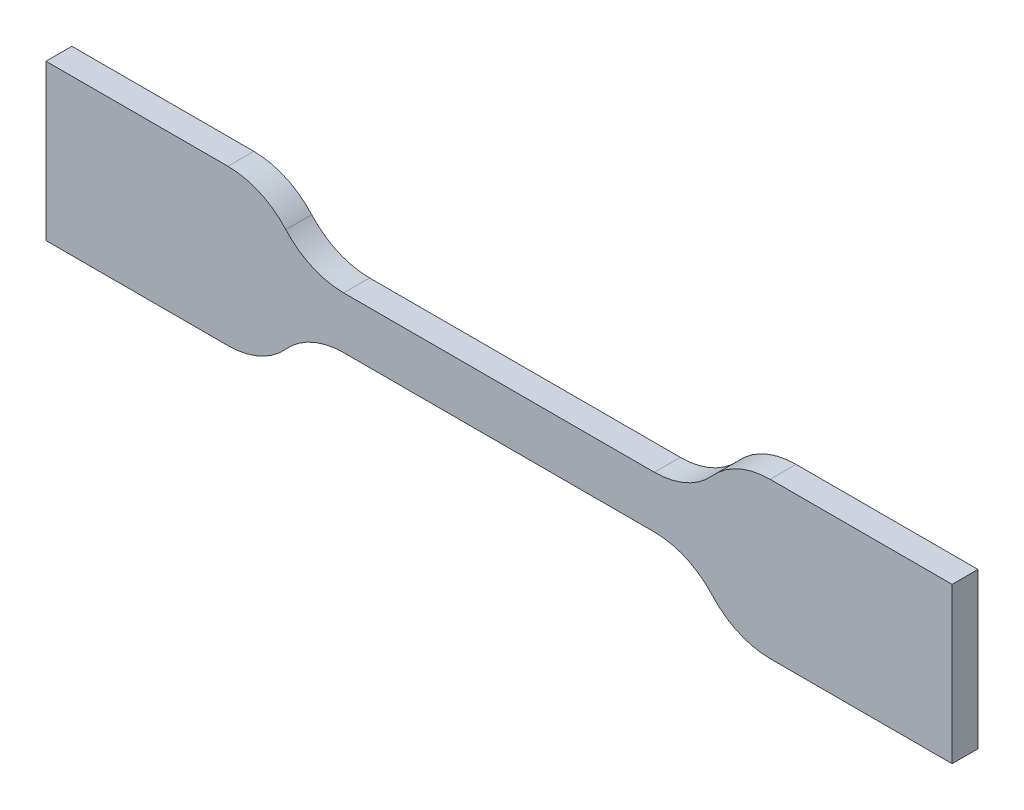
ISO-10303-21;
HEADER;
FILE_DESCRIPTION(('STEP AP214'),'2;1');
FILE_NAME('part.step','',(''),(''),'','','');
FILE_SCHEMA(('AUTOMOTIVE_DESIGN { 1 0 10303 214 1 1 1 1 }'));
ENDSEC;
DATA;
#1=APPLICATION_CONTEXT('core data for automotive mechanical design processes');
#2=APPLICATION_PROTOCOL_DEFINITION('international standard','automotive_design',2000,#1);
#3=PRODUCT_CONTEXT('',#1,'mechanical');
#4=PRODUCT('Part','Part','',(#3));
#5=PRODUCT_RELATED_PRODUCT_CATEGORY('part','',(#4));
#6=PRODUCT_DEFINITION_FORMATION('','',#4);
#7=PRODUCT_DEFINITION_CONTEXT('part definition',#1,'design');
#8=PRODUCT_DEFINITION('design','',#6,#7);
#9=PRODUCT_DEFINITION_SHAPE('','',#8);
#10=(LENGTH_UNIT() NAMED_UNIT(*) SI_UNIT(.MILLI.,.METRE.));
#11=(NAMED_UNIT(*) PLANE_ANGLE_UNIT() SI_UNIT($,.RADIAN.));
#12=(NAMED_UNIT(*) SI_UNIT($,.STERADIAN.) SOLID_ANGLE_UNIT());
#13=UNCERTAINTY_MEASURE_WITH_UNIT(LENGTH_MEASURE(1.E-05),#10,'distance_accuracy_value','');
#14=(GEOMETRIC_REPRESENTATION_CONTEXT(3) GLOBAL_UNCERTAINTY_ASSIGNED_CONTEXT((#13)) GLOBAL_UNIT_ASSIGNED_CONTEXT((#10,
#11,#12)) REPRESENTATION_CONTEXT('',''));
#15=CARTESIAN_POINT('',(0.,0.,0.));
#16=DIRECTION('',(0.,0.,1.));
#17=DIRECTION('',(1.,0.,0.));
#18=AXIS2_PLACEMENT_3D('',#15,#16,#17);
#19=CARTESIAN_POINT('',(-17.5,3.,0.5));
#20=DIRECTION('',(0.,-1.,0.));
#21=DIRECTION('',(0.,0.,-1.));
#22=AXIS2_PLACEMENT_3D('',#19,#20,#21);
#23=PLANE('',#22);
#24=DIRECTION('',(-1.,0.,0.));
#25=VECTOR('',#24,1.);
#26=CARTESIAN_POINT('',(-17.5,3.,-0.5));
#27=LINE('',#26,#25);
#28=CARTESIAN_POINT('',(-10.4721359549996,3.,-0.5));
#29=VERTEX_POINT('',#28);
#30=CARTESIAN_POINT('',(-17.5,3.,-0.5));
#31=VERTEX_POINT('',#30);
#32=EDGE_CURVE('E194',#29,#31,#27,.T.);
#33=ORIENTED_EDGE('',*,*,#32,.T.);
#34=DIRECTION('',(0.,0.,-1.));
#35=VECTOR('',#34,1.);
#36=CARTESIAN_POINT('',(-17.5,3.,0.5));
#37=LINE('',#36,#35);
#38=CARTESIAN_POINT('',(-17.5,3.,0.5));
#39=VERTEX_POINT('',#38);
#40=EDGE_CURVE('E11',#39,#31,#37,.T.);
#41=ORIENTED_EDGE('',*,*,#40,.F.);
#42=DIRECTION('',(-1.,0.,0.));
#43=VECTOR('',#42,1.);
#44=CARTESIAN_POINT('',(-17.5,3.,0.5));
#45=LINE('',#44,#43);
#46=CARTESIAN_POINT('',(-10.4721359549996,3.,0.5));
#47=VERTEX_POINT('',#46);
#48=EDGE_CURVE('E240',#47,#39,#45,.T.);
#49=ORIENTED_EDGE('',*,*,#48,.F.);
#50=DIRECTION('',(0.,0.,-1.));
#51=VECTOR('',#50,1.);
#52=CARTESIAN_POINT('',(-10.4721359549996,3.,0.5));
#53=LINE('',#52,#51);
#54=EDGE_CURVE('E190',#47,#29,#53,.T.);
#55=ORIENTED_EDGE('',*,*,#54,.T.);
#56=EDGE_LOOP('',(#33,#41,#49,#55));
#57=FACE_BOUND('',#56,.T.);
#58=ADVANCED_FACE('F45',(#57),#23,.F.);
#59=CARTESIAN_POINT('',(-17.5,3.,0.5));
#60=DIRECTION('',(1.,0.,0.));
#61=DIRECTION('',(0.,0.,-1.));
#62=AXIS2_PLACEMENT_3D('',#59,#60,#61);
#63=PLANE('',#62);
#64=DIRECTION('',(0.,-1.,0.));
#65=VECTOR('',#64,1.);
#66=CARTESIAN_POINT('',(-17.5,3.,-0.5));
#67=LINE('',#66,#65);
#68=CARTESIAN_POINT('',(-17.5,-3.,-0.5));
#69=VERTEX_POINT('',#68);
#70=EDGE_CURVE('E198',#31,#69,#67,.T.);
#71=ORIENTED_EDGE('',*,*,#70,.T.);
#72=DIRECTION('',(0.,0.,-1.));
#73=VECTOR('',#72,1.);
#74=CARTESIAN_POINT('',(-17.5,-3.,0.5));
#75=LINE('',#74,#73);
#76=CARTESIAN_POINT('',(-17.5,-3.,0.5));
#77=VERTEX_POINT('',#76);
#78=EDGE_CURVE('E54',#77,#69,#75,.T.);
#79=ORIENTED_EDGE('',*,*,#78,.F.);
#80=DIRECTION('',(0.,-1.,0.));
#81=VECTOR('',#80,1.);
#82=CARTESIAN_POINT('',(-17.5,3.,0.5));
#83=LINE('',#82,#81);
#84=EDGE_CURVE('E129',#39,#77,#83,.T.);
#85=ORIENTED_EDGE('',*,*,#84,.F.);
#86=ORIENTED_EDGE('',*,*,#40,.T.);
#87=EDGE_LOOP('',(#71,#79,#85,#86));
#88=FACE_BOUND('',#87,.T.);
#89=ADVANCED_FACE('F362',(#88),#63,.F.);
#90=CARTESIAN_POINT('',(-17.5,-3.,0.5));
#91=DIRECTION('',(0.,1.,0.));
#92=DIRECTION('',(0.,0.,1.));
#93=AXIS2_PLACEMENT_3D('',#90,#91,#92);
#94=PLANE('',#93);
#95=DIRECTION('',(1.,0.,0.));
#96=VECTOR('',#95,1.);
#97=CARTESIAN_POINT('',(-17.5,-3.,-0.5));
#98=LINE('',#97,#96);
#99=CARTESIAN_POINT('',(-10.4721359549996,-3.,-0.5));
#100=VERTEX_POINT('',#99);
#101=EDGE_CURVE('E201',#69,#100,#98,.T.);
#102=ORIENTED_EDGE('',*,*,#101,.T.);
#103=DIRECTION('',(0.,0.,-1.));
#104=VECTOR('',#103,1.);
#105=CARTESIAN_POINT('',(-10.4721359549996,-3.,0.5));
#106=LINE('',#105,#104);
#107=CARTESIAN_POINT('',(-10.4721359549996,-3.,0.5));
#108=VERTEX_POINT('',#107);
#109=EDGE_CURVE('E283',#108,#100,#106,.T.);
#110=ORIENTED_EDGE('',*,*,#109,.F.);
#111=DIRECTION('',(1.,0.,0.));
#112=VECTOR('',#111,1.);
#113=CARTESIAN_POINT('',(-17.5,-3.,0.5));
#114=LINE('',#113,#112);
#115=EDGE_CURVE('E293',#77,#108,#114,.T.);
#116=ORIENTED_EDGE('',*,*,#115,.F.);
#117=ORIENTED_EDGE('',*,*,#78,.T.);
#118=EDGE_LOOP('',(#102,#110,#116,#117));
#119=FACE_BOUND('',#118,.T.);
#120=ADVANCED_FACE('F291',(#119),#94,.F.);
#121=CARTESIAN_POINT('',(-10.4721359549996,0.,0.5));
#122=DIRECTION('',(0.,0.,-1.));
#123=DIRECTION('',(-1.,0.,0.));
#124=AXIS2_PLACEMENT_3D('',#121,#122,#123);
#125=CYLINDRICAL_SURFACE('',#124,3.);
#126=CARTESIAN_POINT('',(-10.4721359549996,0.,-0.5));
#127=DIRECTION('',(0.,0.,1.));
#128=DIRECTION('',(-1.,0.,0.));
#129=AXIS2_PLACEMENT_3D('',#126,#127,#128);
#130=CIRCLE('',#129,3.);
#131=CARTESIAN_POINT('',(-8.23606797749979,-2.,-0.5));
#132=VERTEX_POINT('',#131);
#133=EDGE_CURVE('E204',#100,#132,#130,.T.);
#134=ORIENTED_EDGE('',*,*,#133,.T.);
#135=DIRECTION('',(0.,0.,-1.));
#136=VECTOR('',#135,1.);
#137=CARTESIAN_POINT('',(-8.23606797749979,-2.,0.5));
#138=LINE('',#137,#136);
#139=CARTESIAN_POINT('',(-8.23606797749979,-2.,0.5));
#140=VERTEX_POINT('',#139);
#141=EDGE_CURVE('E279',#140,#132,#138,.T.);
#142=ORIENTED_EDGE('',*,*,#141,.F.);
#143=CARTESIAN_POINT('',(-10.4721359549996,0.,0.5));
#144=DIRECTION('',(0.,0.,1.));
#145=DIRECTION('',(-1.,0.,0.));
#146=AXIS2_PLACEMENT_3D('',#143,#144,#145);
#147=CIRCLE('',#146,3.);
#148=EDGE_CURVE('E312',#108,#140,#147,.T.);
#149=ORIENTED_EDGE('',*,*,#148,.F.);
#150=ORIENTED_EDGE('',*,*,#109,.T.);
#151=EDGE_LOOP('',(#134,#142,#149,#150));
#152=FACE_BOUND('',#151,.T.);
#153=ADVANCED_FACE('F302',(#152),#125,.T.);
#154=CARTESIAN_POINT('',(-6.,-4.00000000000001,0.5));
#155=DIRECTION('',(0.,0.,-1.));
#156=DIRECTION('',(-1.,0.,0.));
#157=AXIS2_PLACEMENT_3D('',#154,#155,#156);
#158=CYLINDRICAL_SURFACE('',#157,3.);
#159=CARTESIAN_POINT('',(-6.,-4.00000000000001,-0.5));
#160=DIRECTION('',(0.,0.,-1.));
#161=DIRECTION('',(1.,0.,0.));
#162=AXIS2_PLACEMENT_3D('',#159,#160,#161);
#163=CIRCLE('',#162,3.);
#164=CARTESIAN_POINT('',(-6.,-1.00000000000001,-0.5));
#165=VERTEX_POINT('',#164);
#166=EDGE_CURVE('E207',#132,#165,#163,.T.);
#167=ORIENTED_EDGE('',*,*,#166,.T.);
#168=DIRECTION('',(0.,0.,-1.));
#169=VECTOR('',#168,1.);
#170=CARTESIAN_POINT('',(-6.,-1.00000000000001,0.5));
#171=LINE('',#170,#169);
#172=CARTESIAN_POINT('',(-6.,-1.00000000000001,0.5));
#173=VERTEX_POINT('',#172);
#174=EDGE_CURVE('E275',#173,#165,#171,.T.);
#175=ORIENTED_EDGE('',*,*,#174,.F.);
#176=CARTESIAN_POINT('',(-6.,-4.00000000000001,0.5));
#177=DIRECTION('',(0.,0.,-1.));
#178=DIRECTION('',(1.,0.,0.));
#179=AXIS2_PLACEMENT_3D('',#176,#177,#178);
#180=CIRCLE('',#179,3.);
#181=EDGE_CURVE('E308',#140,#173,#180,.T.);
#182=ORIENTED_EDGE('',*,*,#181,.F.);
#183=ORIENTED_EDGE('',*,*,#141,.T.);
#184=EDGE_LOOP('',(#167,#175,#182,#183));
#185=FACE_BOUND('',#184,.T.);
#186=ADVANCED_FACE('F306',(#185),#158,.F.);
#187=CARTESIAN_POINT('',(-6.,-1.00000000000001,0.5));
#188=DIRECTION('',(0.,1.,0.));
#189=DIRECTION('',(0.,0.,1.));
#190=AXIS2_PLACEMENT_3D('',#187,#188,#189);
#191=PLANE('',#190);
#192=DIRECTION('',(1.,0.,0.));
#193=VECTOR('',#192,1.);
#194=CARTESIAN_POINT('',(-6.,-1.00000000000001,-0.5));
#195=LINE('',#194,#193);
#196=CARTESIAN_POINT('',(6.,-1.00000000000001,-0.5));
#197=VERTEX_POINT('',#196);
#198=EDGE_CURVE('E210',#165,#197,#195,.T.);
#199=ORIENTED_EDGE('',*,*,#198,.T.);
#200=DIRECTION('',(0.,0.,-1.));
#201=VECTOR('',#200,1.);
#202=CARTESIAN_POINT('',(6.,-1.00000000000001,0.5));
#203=LINE('',#202,#201);
#204=CARTESIAN_POINT('',(6.,-1.00000000000001,0.5));
#205=VERTEX_POINT('',#204);
#206=EDGE_CURVE('E271',#205,#197,#203,.T.);
#207=ORIENTED_EDGE('',*,*,#206,.F.);
#208=DIRECTION('',(1.,0.,0.));
#209=VECTOR('',#208,1.);
#210=CARTESIAN_POINT('',(-6.,-1.00000000000001,0.5));
#211=LINE('',#210,#209);
#212=EDGE_CURVE('E311',#173,#205,#211,.T.);
#213=ORIENTED_EDGE('',*,*,#212,.F.);
#214=ORIENTED_EDGE('',*,*,#174,.T.);
#215=EDGE_LOOP('',(#199,#207,#213,#214));
#216=FACE_BOUND('',#215,.T.);
#217=ADVANCED_FACE('F375',(#216),#191,.F.);
#218=CARTESIAN_POINT('',(6.,-4.00000000000001,0.5));
#219=DIRECTION('',(0.,0.,-1.));
#220=DIRECTION('',(-1.,0.,0.));
#221=AXIS2_PLACEMENT_3D('',#218,#219,#220);
#222=CYLINDRICAL_SURFACE('',#221,3.);
#223=CARTESIAN_POINT('',(6.,-4.00000000000001,-0.5));
#224=DIRECTION('',(0.,0.,-1.));
#225=DIRECTION('',(1.,0.,0.));
#226=AXIS2_PLACEMENT_3D('',#223,#224,#225);
#227=CIRCLE('',#226,3.);
#228=CARTESIAN_POINT('',(8.23606797749979,-2.00000000000001,-0.5));
#229=VERTEX_POINT('',#228);
#230=EDGE_CURVE('E213',#197,#229,#227,.T.);
#231=ORIENTED_EDGE('',*,*,#230,.T.);
#232=DIRECTION('',(0.,0.,-1.));
#233=VECTOR('',#232,1.);
#234=CARTESIAN_POINT('',(8.23606797749979,-2.00000000000001,0.5));
#235=LINE('',#234,#233);
#236=CARTESIAN_POINT('',(8.23606797749979,-2.00000000000001,0.5));
#237=VERTEX_POINT('',#236);
#238=EDGE_CURVE('E267',#237,#229,#235,.T.);
#239=ORIENTED_EDGE('',*,*,#238,.F.);
#240=CARTESIAN_POINT('',(6.,-4.00000000000001,0.5));
#241=DIRECTION('',(0.,0.,-1.));
#242=DIRECTION('',(1.,0.,0.));
#243=AXIS2_PLACEMENT_3D('',#240,#241,#242);
#244=CIRCLE('',#243,3.);
#245=EDGE_CURVE('E316',#205,#237,#244,.T.);
#246=ORIENTED_EDGE('',*,*,#245,.F.);
#247=ORIENTED_EDGE('',*,*,#206,.T.);
#248=EDGE_LOOP('',(#231,#239,#246,#247));
#249=FACE_BOUND('',#248,.T.);
#250=ADVANCED_FACE('F378',(#249),#222,.F.);
#251=CARTESIAN_POINT('',(10.4721359549996,0.,0.5));
#252=DIRECTION('',(0.,0.,-1.));
#253=DIRECTION('',(-1.,0.,0.));
#254=AXIS2_PLACEMENT_3D('',#251,#252,#253);
#255=CYLINDRICAL_SURFACE('',#254,3.);
#256=CARTESIAN_POINT('',(10.4721359549996,0.,-0.5));
#257=DIRECTION('',(0.,0.,1.));
#258=DIRECTION('',(-1.,0.,0.));
#259=AXIS2_PLACEMENT_3D('',#256,#257,#258);
#260=CIRCLE('',#259,3.);
#261=CARTESIAN_POINT('',(10.4721359549996,-3.,-0.5));
#262=VERTEX_POINT('',#261);
#263=EDGE_CURVE('E216',#229,#262,#260,.T.);
#264=ORIENTED_EDGE('',*,*,#263,.T.);
#265=DIRECTION('',(0.,0.,-1.));
#266=VECTOR('',#265,1.);
#267=CARTESIAN_POINT('',(10.4721359549996,-3.,0.5));
#268=LINE('',#267,#266);
#269=CARTESIAN_POINT('',(10.4721359549996,-3.,0.5));
#270=VERTEX_POINT('',#269);
#271=EDGE_CURVE('E263',#270,#262,#268,.T.);
#272=ORIENTED_EDGE('',*,*,#271,.F.);
#273=CARTESIAN_POINT('',(10.4721359549996,0.,0.5));
#274=DIRECTION('',(0.,0.,1.));
#275=DIRECTION('',(-1.,0.,0.));
#276=AXIS2_PLACEMENT_3D('',#273,#274,#275);
#277=CIRCLE('',#276,3.);
#278=EDGE_CURVE('E323',#237,#270,#277,.T.);
#279=ORIENTED_EDGE('',*,*,#278,.F.);
#280=ORIENTED_EDGE('',*,*,#238,.T.);
#281=EDGE_LOOP('',(#264,#272,#279,#280));
#282=FACE_BOUND('',#281,.T.);
#283=ADVANCED_FACE('F382',(#282),#255,.T.);
#284=CARTESIAN_POINT('',(17.5,-3.,0.5));
#285=DIRECTION('',(0.,1.,0.));
#286=DIRECTION('',(0.,0.,1.));
#287=AXIS2_PLACEMENT_3D('',#284,#285,#286);
#288=PLANE('',#287);
#289=DIRECTION('',(1.,0.,0.));
#290=VECTOR('',#289,1.);
#291=CARTESIAN_POINT('',(17.5,-3.,-0.5));
#292=LINE('',#291,#290);
#293=CARTESIAN_POINT('',(17.5,-3.,-0.5));
#294=VERTEX_POINT('',#293);
#295=EDGE_CURVE('E219',#262,#294,#292,.T.);
#296=ORIENTED_EDGE('',*,*,#295,.T.);
#297=DIRECTION('',(0.,0.,-1.));
#298=VECTOR('',#297,1.);
#299=CARTESIAN_POINT('',(17.5,-3.,0.5));
#300=LINE('',#299,#298);
#301=CARTESIAN_POINT('',(17.5,-3.,0.5));
#302=VERTEX_POINT('',#301);
#303=EDGE_CURVE('E259',#302,#294,#300,.T.);
#304=ORIENTED_EDGE('',*,*,#303,.F.);
#305=DIRECTION('',(1.,0.,0.));
#306=VECTOR('',#305,1.);
#307=CARTESIAN_POINT('',(17.5,-3.,0.5));
#308=LINE('',#307,#306);
#309=EDGE_CURVE('E326',#270,#302,#308,.T.);
#310=ORIENTED_EDGE('',*,*,#309,.F.);
#311=ORIENTED_EDGE('',*,*,#271,.T.);
#312=EDGE_LOOP('',(#296,#304,#310,#311));
#313=FACE_BOUND('',#312,.T.);
#314=ADVANCED_FACE('F386',(#313),#288,.F.);
#315=CARTESIAN_POINT('',(17.5,3.,0.5));
#316=DIRECTION('',(-1.,0.,0.));
#317=DIRECTION('',(0.,0.,1.));
#318=AXIS2_PLACEMENT_3D('',#315,#316,#317);
#319=PLANE('',#318);
#320=DIRECTION('',(0.,1.,0.));
#321=VECTOR('',#320,1.);
#322=CARTESIAN_POINT('',(17.5,3.,-0.5));
#323=LINE('',#322,#321);
#324=CARTESIAN_POINT('',(17.5,3.,-0.5));
#325=VERTEX_POINT('',#324);
#326=EDGE_CURVE('E222',#294,#325,#323,.T.);
#327=ORIENTED_EDGE('',*,*,#326,.T.);
#328=DIRECTION('',(0.,0.,-1.));
#329=VECTOR('',#328,1.);
#330=CARTESIAN_POINT('',(17.5,3.,0.5));
#331=LINE('',#330,#329);
#332=CARTESIAN_POINT('',(17.5,3.,0.5));
#333=VERTEX_POINT('',#332);
#334=EDGE_CURVE('E255',#333,#325,#331,.T.);
#335=ORIENTED_EDGE('',*,*,#334,.F.);
#336=DIRECTION('',(0.,1.,0.));
#337=VECTOR('',#336,1.);
#338=CARTESIAN_POINT('',(17.5,3.,0.5));
#339=LINE('',#338,#337);
#340=EDGE_CURVE('E329',#302,#333,#339,.T.);
#341=ORIENTED_EDGE('',*,*,#340,.F.);
#342=ORIENTED_EDGE('',*,*,#303,.T.);
#343=EDGE_LOOP('',(#327,#335,#341,#342));
#344=FACE_BOUND('',#343,.T.);
#345=ADVANCED_FACE('F390',(#344),#319,.F.);
#346=CARTESIAN_POINT('',(10.4721359549996,3.,0.5));
#347=DIRECTION('',(0.,-1.,0.));
#348=DIRECTION('',(0.,0.,-1.));
#349=AXIS2_PLACEMENT_3D('',#346,#347,#348);
#350=PLANE('',#349);
#351=DIRECTION('',(-1.,0.,0.));
#352=VECTOR('',#351,1.);
#353=CARTESIAN_POINT('',(10.4721359549996,3.,-0.5));
#354=LINE('',#353,#352);
#355=CARTESIAN_POINT('',(10.4721359549996,3.,-0.5));
#356=VERTEX_POINT('',#355);
#357=EDGE_CURVE('E225',#325,#356,#354,.T.);
#358=ORIENTED_EDGE('',*,*,#357,.T.);
#359=DIRECTION('',(0.,0.,-1.));
#360=VECTOR('',#359,1.);
#361=CARTESIAN_POINT('',(10.4721359549996,3.,0.5));
#362=LINE('',#361,#360);
#363=CARTESIAN_POINT('',(10.4721359549996,3.,0.5));
#364=VERTEX_POINT('',#363);
#365=EDGE_CURVE('E251',#364,#356,#362,.T.);
#366=ORIENTED_EDGE('',*,*,#365,.F.);
#367=DIRECTION('',(-1.,0.,0.));
#368=VECTOR('',#367,1.);
#369=CARTESIAN_POINT('',(10.4721359549996,3.,0.5));
#370=LINE('',#369,#368);
#371=EDGE_CURVE('E332',#333,#364,#370,.T.);
#372=ORIENTED_EDGE('',*,*,#371,.F.);
#373=ORIENTED_EDGE('',*,*,#334,.T.);
#374=EDGE_LOOP('',(#358,#366,#372,#373));
#375=FACE_BOUND('',#374,.T.);
#376=ADVANCED_FACE('F394',(#375),#350,.F.);
#377=CARTESIAN_POINT('',(10.4721359549996,0.,0.5));
#378=DIRECTION('',(0.,0.,-1.));
#379=DIRECTION('',(-1.,0.,0.));
#380=AXIS2_PLACEMENT_3D('',#377,#378,#379);
#381=CYLINDRICAL_SURFACE('',#380,3.);
#382=CARTESIAN_POINT('',(10.4721359549996,0.,-0.5));
#383=DIRECTION('',(0.,0.,1.));
#384=DIRECTION('',(-1.,0.,0.));
#385=AXIS2_PLACEMENT_3D('',#382,#383,#384);
#386=CIRCLE('',#385,3.);
#387=CARTESIAN_POINT('',(8.23606797749979,2.,-0.5));
#388=VERTEX_POINT('',#387);
#389=EDGE_CURVE('E228',#356,#388,#386,.T.);
#390=ORIENTED_EDGE('',*,*,#389,.T.);
#391=DIRECTION('',(0.,0.,-1.));
#392=VECTOR('',#391,1.);
#393=CARTESIAN_POINT('',(8.23606797749979,2.,0.5));
#394=LINE('',#393,#392);
#395=CARTESIAN_POINT('',(8.23606797749979,2.,0.5));
#396=VERTEX_POINT('',#395);
#397=EDGE_CURVE('E247',#396,#388,#394,.T.);
#398=ORIENTED_EDGE('',*,*,#397,.F.);
#399=CARTESIAN_POINT('',(10.4721359549996,0.,0.5));
#400=DIRECTION('',(0.,0.,1.));
#401=DIRECTION('',(-1.,0.,0.));
#402=AXIS2_PLACEMENT_3D('',#399,#400,#401);
#403=CIRCLE('',#402,3.);
#404=EDGE_CURVE('E335',#364,#396,#403,.T.);
#405=ORIENTED_EDGE('',*,*,#404,.F.);
#406=ORIENTED_EDGE('',*,*,#365,.T.);
#407=EDGE_LOOP('',(#390,#398,#405,#406));
#408=FACE_BOUND('',#407,.T.);
#409=ADVANCED_FACE('F343',(#408),#381,.T.);
#410=CARTESIAN_POINT('',(6.,3.99999999999999,0.5));
#411=DIRECTION('',(0.,0.,-1.));
#412=DIRECTION('',(-1.,0.,0.));
#413=AXIS2_PLACEMENT_3D('',#410,#411,#412);
#414=CYLINDRICAL_SURFACE('',#413,3.);
#415=CARTESIAN_POINT('',(6.,3.99999999999999,-0.5));
#416=DIRECTION('',(0.,0.,-1.));
#417=DIRECTION('',(1.,0.,0.));
#418=AXIS2_PLACEMENT_3D('',#415,#416,#417);
#419=CIRCLE('',#418,3.);
#420=CARTESIAN_POINT('',(6.,0.999999999999991,-0.5));
#421=VERTEX_POINT('',#420);
#422=EDGE_CURVE('E231',#388,#421,#419,.T.);
#423=ORIENTED_EDGE('',*,*,#422,.T.);
#424=DIRECTION('',(0.,0.,-1.));
#425=VECTOR('',#424,1.);
#426=CARTESIAN_POINT('',(6.,0.999999999999991,0.5));
#427=LINE('',#426,#425);
#428=CARTESIAN_POINT('',(6.,0.999999999999991,0.5));
#429=VERTEX_POINT('',#428);
#430=EDGE_CURVE('E183',#429,#421,#427,.T.);
#431=ORIENTED_EDGE('',*,*,#430,.F.);
#432=CARTESIAN_POINT('',(6.,3.99999999999999,0.5));
#433=DIRECTION('',(0.,0.,-1.));
#434=DIRECTION('',(1.,0.,0.));
#435=AXIS2_PLACEMENT_3D('',#432,#433,#434);
#436=CIRCLE('',#435,3.);
#437=EDGE_CURVE('E172',#396,#429,#436,.T.);
#438=ORIENTED_EDGE('',*,*,#437,.F.);
#439=ORIENTED_EDGE('',*,*,#397,.T.);
#440=EDGE_LOOP('',(#423,#431,#438,#439));
#441=FACE_BOUND('',#440,.T.);
#442=ADVANCED_FACE('F347',(#441),#414,.F.);
#443=CARTESIAN_POINT('',(-6.,0.99999999999999,0.5));
#444=DIRECTION('',(0.,-1.,0.));
#445=DIRECTION('',(0.,0.,-1.));
#446=AXIS2_PLACEMENT_3D('',#443,#444,#445);
#447=PLANE('',#446);
#448=DIRECTION('',(-1.,0.,0.));
#449=VECTOR('',#448,1.);
#450=CARTESIAN_POINT('',(-6.,0.99999999999999,-0.5));
#451=LINE('',#450,#449);
#452=CARTESIAN_POINT('',(-6.,0.99999999999999,-0.5));
#453=VERTEX_POINT('',#452);
#454=EDGE_CURVE('E181',#421,#453,#451,.T.);
#455=ORIENTED_EDGE('',*,*,#454,.T.);
#456=DIRECTION('',(0.,0.,-1.));
#457=VECTOR('',#456,1.);
#458=CARTESIAN_POINT('',(-6.,0.99999999999999,0.5));
#459=LINE('',#458,#457);
#460=CARTESIAN_POINT('',(-6.,0.99999999999999,0.5));
#461=VERTEX_POINT('',#460);
#462=EDGE_CURVE('E178',#461,#453,#459,.T.);
#463=ORIENTED_EDGE('',*,*,#462,.F.);
#464=DIRECTION('',(-1.,0.,0.));
#465=VECTOR('',#464,1.);
#466=CARTESIAN_POINT('',(-6.,0.99999999999999,0.5));
#467=LINE('',#466,#465);
#468=EDGE_CURVE('E166',#429,#461,#467,.T.);
#469=ORIENTED_EDGE('',*,*,#468,.F.);
#470=ORIENTED_EDGE('',*,*,#430,.T.);
#471=EDGE_LOOP('',(#455,#463,#469,#470));
#472=FACE_BOUND('',#471,.T.);
#473=ADVANCED_FACE('F179',(#472),#447,.F.);
#474=CARTESIAN_POINT('',(-6.,3.99999999999999,0.5));
#475=DIRECTION('',(0.,0.,-1.));
#476=DIRECTION('',(-1.,0.,0.));
#477=AXIS2_PLACEMENT_3D('',#474,#475,#476);
#478=CYLINDRICAL_SURFACE('',#477,3.);
#479=CARTESIAN_POINT('',(-6.,3.99999999999999,-0.5));
#480=DIRECTION('',(0.,0.,-1.));
#481=DIRECTION('',(1.,0.,0.));
#482=AXIS2_PLACEMENT_3D('',#479,#480,#481);
#483=CIRCLE('',#482,3.);
#484=CARTESIAN_POINT('',(-8.2360679774998,2.,-0.5));
#485=VERTEX_POINT('',#484);
#486=EDGE_CURVE('E115',#453,#485,#483,.T.);
#487=ORIENTED_EDGE('',*,*,#486,.T.);
#488=DIRECTION('',(0.,0.,-1.));
#489=VECTOR('',#488,1.);
#490=CARTESIAN_POINT('',(-8.2360679774998,2.,0.5));
#491=LINE('',#490,#489);
#492=CARTESIAN_POINT('',(-8.2360679774998,2.,0.5));
#493=VERTEX_POINT('',#492);
#494=EDGE_CURVE('E184',#493,#485,#491,.T.);
#495=ORIENTED_EDGE('',*,*,#494,.F.);
#496=CARTESIAN_POINT('',(-6.,3.99999999999999,0.5));
#497=DIRECTION('',(0.,0.,-1.));
#498=DIRECTION('',(1.,0.,0.));
#499=AXIS2_PLACEMENT_3D('',#496,#497,#498);
#500=CIRCLE('',#499,3.);
#501=EDGE_CURVE('E170',#461,#493,#500,.T.);
#502=ORIENTED_EDGE('',*,*,#501,.F.);
#503=ORIENTED_EDGE('',*,*,#462,.T.);
#504=EDGE_LOOP('',(#487,#495,#502,#503));
#505=FACE_BOUND('',#504,.T.);
#506=ADVANCED_FACE('F186',(#505),#478,.F.);
#507=CARTESIAN_POINT('',(-10.4721359549996,0.,0.5));
#508=DIRECTION('',(0.,0.,-1.));
#509=DIRECTION('',(-1.,0.,0.));
#510=AXIS2_PLACEMENT_3D('',#507,#508,#509);
#511=CYLINDRICAL_SURFACE('',#510,3.);
#512=CARTESIAN_POINT('',(-10.4721359549996,0.,-0.5));
#513=DIRECTION('',(0.,0.,1.));
#514=DIRECTION('',(-1.,0.,0.));
#515=AXIS2_PLACEMENT_3D('',#512,#513,#514);
#516=CIRCLE('',#515,3.);
#517=EDGE_CURVE('E121',#485,#29,#516,.T.);
#518=ORIENTED_EDGE('',*,*,#517,.T.);
#519=ORIENTED_EDGE('',*,*,#54,.F.);
#520=CARTESIAN_POINT('',(-10.4721359549996,0.,0.5));
#521=DIRECTION('',(0.,0.,1.));
#522=DIRECTION('',(-1.,0.,0.));
#523=AXIS2_PLACEMENT_3D('',#520,#521,#522);
#524=CIRCLE('',#523,3.);
#525=EDGE_CURVE('E62',#493,#47,#524,.T.);
#526=ORIENTED_EDGE('',*,*,#525,.F.);
#527=ORIENTED_EDGE('',*,*,#494,.T.);
#528=EDGE_LOOP('',(#518,#519,#526,#527));
#529=FACE_BOUND('',#528,.T.);
#530=ADVANCED_FACE('F351',(#529),#511,.T.);
#531=CARTESIAN_POINT('',(-10.4721359549996,0.,0.5));
#532=DIRECTION('',(0.,0.,-1.));
#533=DIRECTION('',(-1.,0.,0.));
#534=AXIS2_PLACEMENT_3D('',#531,#532,#533);
#535=PLANE('',#534);
#536=ORIENTED_EDGE('',*,*,#48,.T.);
#537=ORIENTED_EDGE('',*,*,#84,.T.);
#538=ORIENTED_EDGE('',*,*,#115,.T.);
#539=ORIENTED_EDGE('',*,*,#148,.T.);
#540=ORIENTED_EDGE('',*,*,#181,.T.);
#541=ORIENTED_EDGE('',*,*,#212,.T.);
#542=ORIENTED_EDGE('',*,*,#245,.T.);
#543=ORIENTED_EDGE('',*,*,#278,.T.);
#544=ORIENTED_EDGE('',*,*,#309,.T.);
#545=ORIENTED_EDGE('',*,*,#340,.T.);
#546=ORIENTED_EDGE('',*,*,#371,.T.);
#547=ORIENTED_EDGE('',*,*,#404,.T.);
#548=ORIENTED_EDGE('',*,*,#437,.T.);
#549=ORIENTED_EDGE('',*,*,#468,.T.);
#550=ORIENTED_EDGE('',*,*,#501,.T.);
#551=ORIENTED_EDGE('',*,*,#525,.T.);
#552=EDGE_LOOP('',(#536,#537,#538,#539,#540,#541,#542,#543,#544,#545,#546,#547,#548,#549,#550,#551));
#553=FACE_BOUND('',#552,.T.);
#554=ADVANCED_FACE('F168',(#553),#535,.F.);
#555=CARTESIAN_POINT('',(-10.4721359549996,0.,-0.5));
#556=DIRECTION('',(0.,0.,-1.));
#557=DIRECTION('',(-1.,0.,0.));
#558=AXIS2_PLACEMENT_3D('',#555,#556,#557);
#559=PLANE('',#558);
#560=ORIENTED_EDGE('',*,*,#32,.F.);
#561=ORIENTED_EDGE('',*,*,#517,.F.);
#562=ORIENTED_EDGE('',*,*,#486,.F.);
#563=ORIENTED_EDGE('',*,*,#454,.F.);
#564=ORIENTED_EDGE('',*,*,#422,.F.);
#565=ORIENTED_EDGE('',*,*,#389,.F.);
#566=ORIENTED_EDGE('',*,*,#357,.F.);
#567=ORIENTED_EDGE('',*,*,#326,.F.);
#568=ORIENTED_EDGE('',*,*,#295,.F.);
#569=ORIENTED_EDGE('',*,*,#263,.F.);
#570=ORIENTED_EDGE('',*,*,#230,.F.);
#571=ORIENTED_EDGE('',*,*,#198,.F.);
#572=ORIENTED_EDGE('',*,*,#166,.F.);
#573=ORIENTED_EDGE('',*,*,#133,.F.);
#574=ORIENTED_EDGE('',*,*,#101,.F.);
#575=ORIENTED_EDGE('',*,*,#70,.F.);
#576=EDGE_LOOP('',(#560,#561,#562,#563,#564,#565,#566,#567,#568,#569,#570,#571,#572,#573,#574,#575));
#577=FACE_BOUND('',#576,.T.);
#578=ADVANCED_FACE('F297',(#577),#559,.T.);
#579=CLOSED_SHELL('',(#58,#89,#120,#153,#186,#217,#250,#283,#314,#345,#376,#409,#442,#473,#506,
#530,#554,#578));
#580=MANIFOLD_SOLID_BREP('B2',#579);
#581=ADVANCED_BREP_SHAPE_REPRESENTATION('',(#18,#580),#14);
#582=SHAPE_DEFINITION_REPRESENTATION(#9,#581);
ENDSEC;
END-ISO-10303-21;
